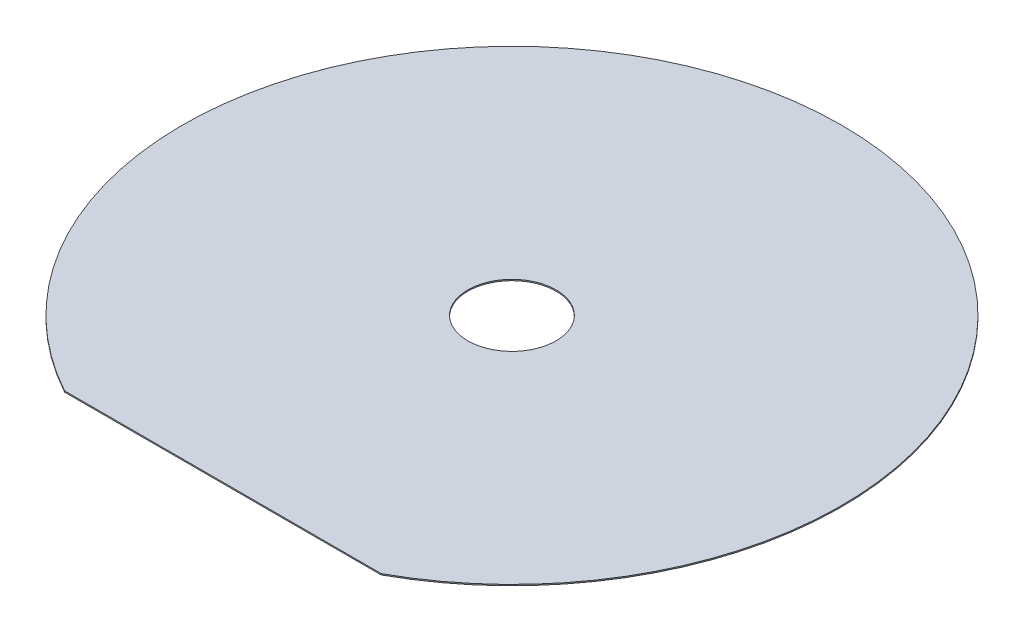
ISO-10303-21;
HEADER;
FILE_DESCRIPTION(('STEP AP214'),'2;1');
FILE_NAME('part.step','',(''),(''),'','','');
FILE_SCHEMA(('AUTOMOTIVE_DESIGN { 1 0 10303 214 1 1 1 1 }'));
ENDSEC;
DATA;
#1=APPLICATION_CONTEXT('core data for automotive mechanical design processes');
#2=APPLICATION_PROTOCOL_DEFINITION('international standard','automotive_design',2000,#1);
#3=PRODUCT_CONTEXT('',#1,'mechanical');
#4=PRODUCT('Part','Part','',(#3));
#5=PRODUCT_RELATED_PRODUCT_CATEGORY('part','',(#4));
#6=PRODUCT_DEFINITION_FORMATION('','',#4);
#7=PRODUCT_DEFINITION_CONTEXT('part definition',#1,'design');
#8=PRODUCT_DEFINITION('design','',#6,#7);
#9=PRODUCT_DEFINITION_SHAPE('','',#8);
#10=(LENGTH_UNIT() NAMED_UNIT(*) SI_UNIT(.MILLI.,.METRE.));
#11=(NAMED_UNIT(*) PLANE_ANGLE_UNIT() SI_UNIT($,.RADIAN.));
#12=(NAMED_UNIT(*) SI_UNIT($,.STERADIAN.) SOLID_ANGLE_UNIT());
#13=UNCERTAINTY_MEASURE_WITH_UNIT(LENGTH_MEASURE(1.E-05),#10,'distance_accuracy_value','');
#14=(GEOMETRIC_REPRESENTATION_CONTEXT(3) GLOBAL_UNCERTAINTY_ASSIGNED_CONTEXT((#13)) GLOBAL_UNIT_ASSIGNED_CONTEXT((#10,
#11,#12)) REPRESENTATION_CONTEXT('',''));
#15=CARTESIAN_POINT('',(0.,0.,0.));
#16=DIRECTION('',(0.,0.,1.));
#17=DIRECTION('',(1.,0.,0.));
#18=AXIS2_PLACEMENT_3D('',#15,#16,#17);
#19=CARTESIAN_POINT('',(0.,892.,0.));
#20=DIRECTION('',(0.,1.,0.));
#21=DIRECTION('',(0.,0.,1.));
#22=AXIS2_PLACEMENT_3D('',#19,#20,#21);
#23=PLANE('',#22);
#24=CARTESIAN_POINT('',(0.,892.,0.));
#25=DIRECTION('',(0.,1.,0.));
#26=DIRECTION('',(0.,0.,1.));
#27=AXIS2_PLACEMENT_3D('',#24,#25,#26);
#28=CIRCLE('',#27,560.);
#29=CARTESIAN_POINT('',(269.,892.,491.160869776899));
#30=VERTEX_POINT('',#29);
#31=CARTESIAN_POINT('',(-269.,892.,491.160869776899));
#32=VERTEX_POINT('',#31);
#33=EDGE_CURVE('E67',#30,#32,#28,.T.);
#34=ORIENTED_EDGE('',*,*,#33,.T.);
#35=DIRECTION('',(1.,0.,0.));
#36=VECTOR('',#35,1.);
#37=CARTESIAN_POINT('',(-269.,892.,491.160869776899));
#38=LINE('',#37,#36);
#39=EDGE_CURVE('E52',#32,#30,#38,.T.);
#40=ORIENTED_EDGE('',*,*,#39,.T.);
#41=EDGE_LOOP('',(#34,#40));
#42=FACE_BOUND('',#41,.T.);
#43=CARTESIAN_POINT('',(0.,892.,0.));
#44=DIRECTION('',(0.,1.,0.));
#45=DIRECTION('',(0.,0.,1.));
#46=AXIS2_PLACEMENT_3D('',#43,#44,#45);
#47=CIRCLE('',#46,75.);
#48=CARTESIAN_POINT('',(0.,892.,75.));
#49=VERTEX_POINT('',#48);
#50=EDGE_CURVE('E73',#49,#49,#47,.T.);
#51=ORIENTED_EDGE('',*,*,#50,.F.);
#52=EDGE_LOOP('',(#51));
#53=FACE_BOUND('',#52,.T.);
#54=ADVANCED_FACE('F36',(#42,#53),#23,.T.);
#55=CARTESIAN_POINT('',(0.,890.,0.));
#56=DIRECTION('',(0.,1.,0.));
#57=DIRECTION('',(0.,0.,1.));
#58=AXIS2_PLACEMENT_3D('',#55,#56,#57);
#59=PLANE('',#58);
#60=CARTESIAN_POINT('',(0.,890.,0.));
#61=DIRECTION('',(0.,1.,0.));
#62=DIRECTION('',(0.,0.,1.));
#63=AXIS2_PLACEMENT_3D('',#60,#61,#62);
#64=CIRCLE('',#63,560.);
#65=CARTESIAN_POINT('',(269.,890.,491.160869776899));
#66=VERTEX_POINT('',#65);
#67=CARTESIAN_POINT('',(-269.,890.,491.160869776899));
#68=VERTEX_POINT('',#67);
#69=EDGE_CURVE('E68',#66,#68,#64,.T.);
#70=ORIENTED_EDGE('',*,*,#69,.F.);
#71=DIRECTION('',(1.,0.,0.));
#72=VECTOR('',#71,1.);
#73=CARTESIAN_POINT('',(-269.,890.,491.160869776899));
#74=LINE('',#73,#72);
#75=EDGE_CURVE('E60',#68,#66,#74,.T.);
#76=ORIENTED_EDGE('',*,*,#75,.F.);
#77=EDGE_LOOP('',(#70,#76));
#78=FACE_BOUND('',#77,.T.);
#79=CARTESIAN_POINT('',(0.,890.,0.));
#80=DIRECTION('',(0.,1.,0.));
#81=DIRECTION('',(0.,0.,1.));
#82=AXIS2_PLACEMENT_3D('',#79,#80,#81);
#83=CIRCLE('',#82,75.);
#84=CARTESIAN_POINT('',(0.,890.,75.));
#85=VERTEX_POINT('',#84);
#86=EDGE_CURVE('E76',#85,#85,#83,.T.);
#87=ORIENTED_EDGE('',*,*,#86,.T.);
#88=EDGE_LOOP('',(#87));
#89=FACE_BOUND('',#88,.T.);
#90=ADVANCED_FACE('F71',(#78,#89),#59,.F.);
#91=CARTESIAN_POINT('',(0.,892.,0.));
#92=DIRECTION('',(0.,-1.,0.));
#93=DIRECTION('',(0.,0.,-1.));
#94=AXIS2_PLACEMENT_3D('',#91,#92,#93);
#95=CYLINDRICAL_SURFACE('',#94,560.);
#96=ORIENTED_EDGE('',*,*,#69,.T.);
#97=DIRECTION('',(0.,-1.,0.));
#98=VECTOR('',#97,1.);
#99=CARTESIAN_POINT('',(-269.,892.,491.160869776899));
#100=LINE('',#99,#98);
#101=EDGE_CURVE('E11',#32,#68,#100,.T.);
#102=ORIENTED_EDGE('',*,*,#101,.F.);
#103=ORIENTED_EDGE('',*,*,#33,.F.);
#104=DIRECTION('',(0.,-1.,0.));
#105=VECTOR('',#104,1.);
#106=CARTESIAN_POINT('',(269.,892.,491.160869776899));
#107=LINE('',#106,#105);
#108=EDGE_CURVE('E45',#30,#66,#107,.T.);
#109=ORIENTED_EDGE('',*,*,#108,.T.);
#110=EDGE_LOOP('',(#96,#102,#103,#109));
#111=FACE_BOUND('',#110,.T.);
#112=ADVANCED_FACE('F38',(#111),#95,.T.);
#113=CARTESIAN_POINT('',(-269.,892.,491.160869776899));
#114=DIRECTION('',(0.,0.,-1.));
#115=DIRECTION('',(-1.,0.,0.));
#116=AXIS2_PLACEMENT_3D('',#113,#114,#115);
#117=PLANE('',#116);
#118=ORIENTED_EDGE('',*,*,#75,.T.);
#119=ORIENTED_EDGE('',*,*,#108,.F.);
#120=ORIENTED_EDGE('',*,*,#39,.F.);
#121=ORIENTED_EDGE('',*,*,#101,.T.);
#122=EDGE_LOOP('',(#118,#119,#120,#121));
#123=FACE_BOUND('',#122,.T.);
#124=ADVANCED_FACE('F63',(#123),#117,.F.);
#125=CARTESIAN_POINT('',(0.,892.,0.));
#126=DIRECTION('',(0.,-1.,0.));
#127=DIRECTION('',(0.,0.,-1.));
#128=AXIS2_PLACEMENT_3D('',#125,#126,#127);
#129=CYLINDRICAL_SURFACE('',#128,75.);
#130=ORIENTED_EDGE('',*,*,#50,.T.);
#131=EDGE_LOOP('',(#130));
#132=FACE_BOUND('',#131,.T.);
#133=ORIENTED_EDGE('',*,*,#86,.F.);
#134=EDGE_LOOP('',(#133));
#135=FACE_BOUND('',#134,.T.);
#136=ADVANCED_FACE('F84',(#132,#135),#129,.F.);
#137=CLOSED_SHELL('',(#54,#90,#112,#124,#136));
#138=MANIFOLD_SOLID_BREP('B2',#137);
#139=ADVANCED_BREP_SHAPE_REPRESENTATION('',(#18,#138),#14);
#140=SHAPE_DEFINITION_REPRESENTATION(#9,#139);
ENDSEC;
END-ISO-10303-21;
